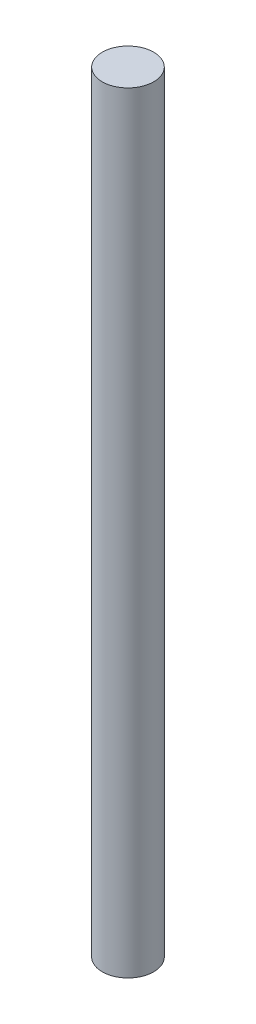
ISO-10303-21;
HEADER;
FILE_DESCRIPTION(('STEP AP214'),'2;1');
FILE_NAME('part.step','',(''),(''),'','','');
FILE_SCHEMA(('AUTOMOTIVE_DESIGN { 1 0 10303 214 1 1 1 1 }'));
ENDSEC;
DATA;
#1=APPLICATION_CONTEXT('core data for automotive mechanical design processes');
#2=APPLICATION_PROTOCOL_DEFINITION('international standard','automotive_design',2000,#1);
#3=PRODUCT_CONTEXT('',#1,'mechanical');
#4=PRODUCT('Part','Part','',(#3));
#5=PRODUCT_RELATED_PRODUCT_CATEGORY('part','',(#4));
#6=PRODUCT_DEFINITION_FORMATION('','',#4);
#7=PRODUCT_DEFINITION_CONTEXT('part definition',#1,'design');
#8=PRODUCT_DEFINITION('design','',#6,#7);
#9=PRODUCT_DEFINITION_SHAPE('','',#8);
#10=(LENGTH_UNIT() NAMED_UNIT(*) SI_UNIT(.MILLI.,.METRE.));
#11=(NAMED_UNIT(*) PLANE_ANGLE_UNIT() SI_UNIT($,.RADIAN.));
#12=(NAMED_UNIT(*) SI_UNIT($,.STERADIAN.) SOLID_ANGLE_UNIT());
#13=UNCERTAINTY_MEASURE_WITH_UNIT(LENGTH_MEASURE(1.E-05),#10,'distance_accuracy_value','');
#14=(GEOMETRIC_REPRESENTATION_CONTEXT(3) GLOBAL_UNCERTAINTY_ASSIGNED_CONTEXT((#13)) GLOBAL_UNIT_ASSIGNED_CONTEXT((#10,
#11,#12)) REPRESENTATION_CONTEXT('',''));
#15=CARTESIAN_POINT('',(0.,0.,0.));
#16=DIRECTION('',(0.,0.,1.));
#17=DIRECTION('',(1.,0.,0.));
#18=AXIS2_PLACEMENT_3D('',#15,#16,#17);
#19=CARTESIAN_POINT('',(0.,95.25,0.));
#20=DIRECTION('',(0.,-1.,0.));
#21=DIRECTION('',(0.,0.,-1.));
#22=AXIS2_PLACEMENT_3D('',#19,#20,#21);
#23=CYLINDRICAL_SURFACE('',#22,3.175);
#24=CARTESIAN_POINT('',(0.,95.25,0.));
#25=DIRECTION('',(0.,1.,0.));
#26=DIRECTION('',(0.,0.,1.));
#27=AXIS2_PLACEMENT_3D('',#24,#25,#26);
#28=CIRCLE('',#27,3.175);
#29=CARTESIAN_POINT('',(0.,95.25,3.175));
#30=VERTEX_POINT('',#29);
#31=EDGE_CURVE('E10',#30,#30,#28,.T.);
#32=ORIENTED_EDGE('',*,*,#31,.F.);
#33=EDGE_LOOP('',(#32));
#34=FACE_BOUND('',#33,.T.);
#35=CARTESIAN_POINT('',(0.,0.,0.));
#36=DIRECTION('',(0.,1.,0.));
#37=DIRECTION('',(0.,0.,1.));
#38=AXIS2_PLACEMENT_3D('',#35,#36,#37);
#39=CIRCLE('',#38,3.175);
#40=CARTESIAN_POINT('',(0.,0.,3.175));
#41=VERTEX_POINT('',#40);
#42=EDGE_CURVE('E44',#41,#41,#39,.T.);
#43=ORIENTED_EDGE('',*,*,#42,.T.);
#44=EDGE_LOOP('',(#43));
#45=FACE_BOUND('',#44,.T.);
#46=ADVANCED_FACE('F41',(#34,#45),#23,.T.);
#47=CARTESIAN_POINT('',(0.,95.25,0.));
#48=DIRECTION('',(0.,1.,0.));
#49=DIRECTION('',(0.,0.,1.));
#50=AXIS2_PLACEMENT_3D('',#47,#48,#49);
#51=PLANE('',#50);
#52=ORIENTED_EDGE('',*,*,#31,.T.);
#53=EDGE_LOOP('',(#52));
#54=FACE_BOUND('',#53,.T.);
#55=ADVANCED_FACE('F58',(#54),#51,.T.);
#56=CARTESIAN_POINT('',(0.,0.,0.));
#57=DIRECTION('',(0.,1.,0.));
#58=DIRECTION('',(0.,0.,1.));
#59=AXIS2_PLACEMENT_3D('',#56,#57,#58);
#60=PLANE('',#59);
#61=ORIENTED_EDGE('',*,*,#42,.F.);
#62=EDGE_LOOP('',(#61));
#63=FACE_BOUND('',#62,.T.);
#64=ADVANCED_FACE('F56',(#63),#60,.F.);
#65=CLOSED_SHELL('',(#46,#55,#64));
#66=MANIFOLD_SOLID_BREP('B2',#65);
#67=ADVANCED_BREP_SHAPE_REPRESENTATION('',(#18,#66),#14);
#68=SHAPE_DEFINITION_REPRESENTATION(#9,#67);
ENDSEC;
END-ISO-10303-21;
